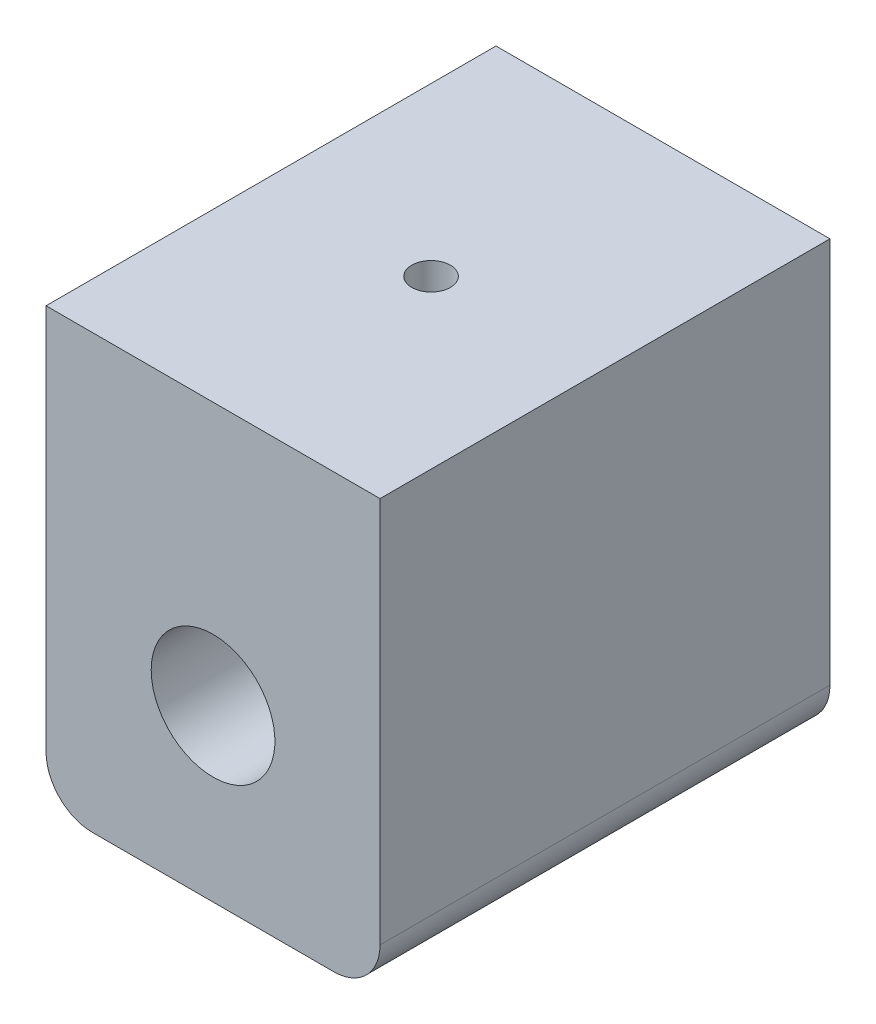
ISO-10303-21;
HEADER;
FILE_DESCRIPTION(('STEP AP214'),'2;1');
FILE_NAME('part.step','',(''),(''),'','','');
FILE_SCHEMA(('AUTOMOTIVE_DESIGN { 1 0 10303 214 1 1 1 1 }'));
ENDSEC;
DATA;
#1=APPLICATION_CONTEXT('core data for automotive mechanical design processes');
#2=APPLICATION_PROTOCOL_DEFINITION('international standard','automotive_design',2000,#1);
#3=PRODUCT_CONTEXT('',#1,'mechanical');
#4=PRODUCT('Part','Part','',(#3));
#5=PRODUCT_RELATED_PRODUCT_CATEGORY('part','',(#4));
#6=PRODUCT_DEFINITION_FORMATION('','',#4);
#7=PRODUCT_DEFINITION_CONTEXT('part definition',#1,'design');
#8=PRODUCT_DEFINITION('design','',#6,#7);
#9=PRODUCT_DEFINITION_SHAPE('','',#8);
#10=(LENGTH_UNIT() NAMED_UNIT(*) SI_UNIT(.MILLI.,.METRE.));
#11=(NAMED_UNIT(*) PLANE_ANGLE_UNIT() SI_UNIT($,.RADIAN.));
#12=(NAMED_UNIT(*) SI_UNIT($,.STERADIAN.) SOLID_ANGLE_UNIT());
#13=UNCERTAINTY_MEASURE_WITH_UNIT(LENGTH_MEASURE(1.E-05),#10,'distance_accuracy_value','');
#14=(GEOMETRIC_REPRESENTATION_CONTEXT(3) GLOBAL_UNCERTAINTY_ASSIGNED_CONTEXT((#13)) GLOBAL_UNIT_ASSIGNED_CONTEXT((#10,
#11,#12)) REPRESENTATION_CONTEXT('',''));
#15=CARTESIAN_POINT('',(0.,0.,0.));
#16=DIRECTION('',(0.,0.,1.));
#17=DIRECTION('',(1.,0.,0.));
#18=AXIS2_PLACEMENT_3D('',#15,#16,#17);
#19=CARTESIAN_POINT('',(-5.86092041698449,10.9504195270786,-63.7));
#20=DIRECTION('',(0.,-1.,0.));
#21=DIRECTION('',(0.,0.,-1.));
#22=AXIS2_PLACEMENT_3D('',#19,#20,#21);
#23=PLANE('',#22);
#24=CARTESIAN_POINT('',(-5.86092041698448,10.9504195270786,-63.7));
#25=DIRECTION('',(0.,-1.,0.));
#26=DIRECTION('',(0.,0.,-1.));
#27=AXIS2_PLACEMENT_3D('',#24,#25,#26);
#28=CIRCLE('',#27,1.25);
#29=CARTESIAN_POINT('',(-5.86092041698448,10.9504195270786,-64.95));
#30=VERTEX_POINT('',#29);
#31=EDGE_CURVE('E21',#30,#30,#28,.F.);
#32=ORIENTED_EDGE('',*,*,#31,.T.);
#33=EDGE_LOOP('',(#32));
#34=FACE_BOUND('',#33,.T.);
#35=ADVANCED_FACE('F18',(#34),#23,.F.);
#36=CARTESIAN_POINT('',(-5.86092041698448,17.9504195270786,-63.7));
#37=DIRECTION('',(0.,-1.,0.));
#38=DIRECTION('',(0.,0.,-1.));
#39=AXIS2_PLACEMENT_3D('',#36,#37,#38);
#40=CYLINDRICAL_SURFACE('',#39,1.25);
#41=CARTESIAN_POINT('',(-5.86092041698448,17.9504195270786,-63.7));
#42=DIRECTION('',(0.,-1.,0.));
#43=DIRECTION('',(0.,0.,-1.));
#44=AXIS2_PLACEMENT_3D('',#41,#42,#43);
#45=CIRCLE('',#44,1.25);
#46=CARTESIAN_POINT('',(-5.86092041698448,17.9504195270786,-64.95));
#47=VERTEX_POINT('',#46);
#48=EDGE_CURVE('E121',#47,#47,#45,.T.);
#49=ORIENTED_EDGE('',*,*,#48,.F.);
#50=EDGE_LOOP('',(#49));
#51=FACE_BOUND('',#50,.T.);
#52=ORIENTED_EDGE('',*,*,#31,.F.);
#53=EDGE_LOOP('',(#52));
#54=FACE_BOUND('',#53,.T.);
#55=ADVANCED_FACE('F156',(#51,#54),#40,.F.);
#56=CARTESIAN_POINT('',(-16.6609204169845,-10.0495804729214,-78.7));
#57=DIRECTION('',(-1.,0.,0.));
#58=DIRECTION('',(0.,0.,1.));
#59=AXIS2_PLACEMENT_3D('',#56,#57,#58);
#60=PLANE('',#59);
#61=DIRECTION('',(0.,1.,0.));
#62=VECTOR('',#61,1.);
#63=CARTESIAN_POINT('',(-16.6609204169845,-0.169434475005503,-78.7));
#64=LINE('',#63,#62);
#65=CARTESIAN_POINT('',(-16.6609204169845,-7.04958047292143,-78.7));
#66=VERTEX_POINT('',#65);
#67=CARTESIAN_POINT('',(-16.6609204169845,17.9504195270786,-78.7));
#68=VERTEX_POINT('',#67);
#69=EDGE_CURVE('E72',#66,#68,#64,.T.);
#70=ORIENTED_EDGE('',*,*,#69,.F.);
#71=DIRECTION('',(0.,0.,-1.));
#72=VECTOR('',#71,1.);
#73=CARTESIAN_POINT('',(-16.6609204169845,-7.04958047292143,-78.7));
#74=LINE('',#73,#72);
#75=CARTESIAN_POINT('',(-16.6609204169845,-7.04958047292143,-49.6));
#76=VERTEX_POINT('',#75);
#77=EDGE_CURVE('E65',#76,#66,#74,.T.);
#78=ORIENTED_EDGE('',*,*,#77,.F.);
#79=DIRECTION('',(0.,1.,0.));
#80=VECTOR('',#79,1.);
#81=CARTESIAN_POINT('',(-16.6609204169845,-0.169434475005503,-49.6));
#82=LINE('',#81,#80);
#83=CARTESIAN_POINT('',(-16.6609204169845,17.9504195270786,-49.6));
#84=VERTEX_POINT('',#83);
#85=EDGE_CURVE('E133',#76,#84,#82,.T.);
#86=ORIENTED_EDGE('',*,*,#85,.T.);
#87=DIRECTION('',(0.,0.,1.));
#88=VECTOR('',#87,1.);
#89=CARTESIAN_POINT('',(-16.6609204169845,17.9504195270786,-78.7));
#90=LINE('',#89,#88);
#91=EDGE_CURVE('E90',#68,#84,#90,.T.);
#92=ORIENTED_EDGE('',*,*,#91,.F.);
#93=EDGE_LOOP('',(#70,#78,#86,#92));
#94=FACE_BOUND('',#93,.T.);
#95=ADVANCED_FACE('F154',(#94),#60,.T.);
#96=CARTESIAN_POINT('',(-13.6609204169845,-7.04958047292143,-78.7));
#97=DIRECTION('',(0.,0.,-1.));
#98=DIRECTION('',(-1.,0.,0.));
#99=AXIS2_PLACEMENT_3D('',#96,#97,#98);
#100=CYLINDRICAL_SURFACE('',#99,3.);
#101=CARTESIAN_POINT('',(-13.6609204169845,-7.04958047292143,-78.7));
#102=DIRECTION('',(0.,0.,-1.));
#103=DIRECTION('',(-1.,0.,0.));
#104=AXIS2_PLACEMENT_3D('',#101,#102,#103);
#105=CIRCLE('',#104,3.);
#106=CARTESIAN_POINT('',(-13.6609204169845,-10.0495804729214,-78.7));
#107=VERTEX_POINT('',#106);
#108=EDGE_CURVE('E112',#107,#66,#105,.T.);
#109=ORIENTED_EDGE('',*,*,#108,.F.);
#110=DIRECTION('',(0.,0.,-1.));
#111=VECTOR('',#110,1.);
#112=CARTESIAN_POINT('',(-13.6609204169845,-10.0495804729214,-78.7));
#113=LINE('',#112,#111);
#114=CARTESIAN_POINT('',(-13.6609204169845,-10.0495804729214,-49.6));
#115=VERTEX_POINT('',#114);
#116=EDGE_CURVE('E60',#115,#107,#113,.T.);
#117=ORIENTED_EDGE('',*,*,#116,.F.);
#118=CARTESIAN_POINT('',(-13.6609204169845,-7.04958047292143,-49.6));
#119=DIRECTION('',(0.,0.,-1.));
#120=DIRECTION('',(-1.,0.,0.));
#121=AXIS2_PLACEMENT_3D('',#118,#119,#120);
#122=CIRCLE('',#121,3.);
#123=EDGE_CURVE('E128',#115,#76,#122,.T.);
#124=ORIENTED_EDGE('',*,*,#123,.T.);
#125=ORIENTED_EDGE('',*,*,#77,.T.);
#126=EDGE_LOOP('',(#109,#117,#124,#125));
#127=FACE_BOUND('',#126,.T.);
#128=ADVANCED_FACE('F135',(#127),#100,.T.);
#129=CARTESIAN_POINT('',(-5.86092041698449,0.950419527078566,-78.7));
#130=DIRECTION('',(0.,0.,-1.));
#131=DIRECTION('',(-1.,0.,0.));
#132=AXIS2_PLACEMENT_3D('',#129,#130,#131);
#133=CYLINDRICAL_SURFACE('',#132,4.);
#134=CARTESIAN_POINT('',(-5.86092041698449,0.950419527078566,-49.6));
#135=DIRECTION('',(0.,0.,-1.));
#136=DIRECTION('',(-1.,0.,0.));
#137=AXIS2_PLACEMENT_3D('',#134,#135,#136);
#138=CIRCLE('',#137,4.);
#139=CARTESIAN_POINT('',(-9.86092041698449,0.950419527078566,-49.6));
#140=VERTEX_POINT('',#139);
#141=EDGE_CURVE('E125',#140,#140,#138,.F.);
#142=ORIENTED_EDGE('',*,*,#141,.T.);
#143=EDGE_LOOP('',(#142));
#144=FACE_BOUND('',#143,.T.);
#145=CARTESIAN_POINT('',(-5.86092041698449,0.950419527078566,-78.7));
#146=DIRECTION('',(0.,0.,-1.));
#147=DIRECTION('',(-1.,0.,0.));
#148=AXIS2_PLACEMENT_3D('',#145,#146,#147);
#149=CIRCLE('',#148,4.);
#150=CARTESIAN_POINT('',(-9.86092041698449,0.950419527078566,-78.7));
#151=VERTEX_POINT('',#150);
#152=EDGE_CURVE('E91',#151,#151,#149,.F.);
#153=ORIENTED_EDGE('',*,*,#152,.F.);
#154=EDGE_LOOP('',(#153));
#155=FACE_BOUND('',#154,.T.);
#156=ADVANCED_FACE('F163',(#144,#155),#133,.F.);
#157=CARTESIAN_POINT('',(4.93907958301551,-10.0495804729214,-78.7));
#158=DIRECTION('',(0.,-1.,0.));
#159=DIRECTION('',(0.,0.,-1.));
#160=AXIS2_PLACEMENT_3D('',#157,#158,#159);
#161=PLANE('',#160);
#162=DIRECTION('',(-1.,0.,0.));
#163=VECTOR('',#162,1.);
#164=CARTESIAN_POINT('',(-7.9824365322079,-10.0495804729214,-49.6));
#165=LINE('',#164,#163);
#166=CARTESIAN_POINT('',(1.93907958301551,-10.0495804729214,-49.6));
#167=VERTEX_POINT('',#166);
#168=EDGE_CURVE('E130',#167,#115,#165,.T.);
#169=ORIENTED_EDGE('',*,*,#168,.T.);
#170=ORIENTED_EDGE('',*,*,#116,.T.);
#171=DIRECTION('',(-1.,0.,0.));
#172=VECTOR('',#171,1.);
#173=CARTESIAN_POINT('',(-7.9824365322079,-10.0495804729214,-78.7));
#174=LINE('',#173,#172);
#175=CARTESIAN_POINT('',(1.93907958301551,-10.0495804729214,-78.7));
#176=VERTEX_POINT('',#175);
#177=EDGE_CURVE('E78',#176,#107,#174,.T.);
#178=ORIENTED_EDGE('',*,*,#177,.F.);
#179=DIRECTION('',(0.,0.,-1.));
#180=VECTOR('',#179,1.);
#181=CARTESIAN_POINT('',(1.93907958301551,-10.0495804729214,-78.7));
#182=LINE('',#181,#180);
#183=EDGE_CURVE('E104',#167,#176,#182,.T.);
#184=ORIENTED_EDGE('',*,*,#183,.F.);
#185=EDGE_LOOP('',(#169,#170,#178,#184));
#186=FACE_BOUND('',#185,.T.);
#187=ADVANCED_FACE('F138',(#186),#161,.T.);
#188=CARTESIAN_POINT('',(-7.9824365322079,-0.169434475005503,-78.7));
#189=DIRECTION('',(0.,0.,-1.));
#190=DIRECTION('',(-1.,0.,0.));
#191=AXIS2_PLACEMENT_3D('',#188,#189,#190);
#192=PLANE('',#191);
#193=ORIENTED_EDGE('',*,*,#152,.T.);
#194=EDGE_LOOP('',(#193));
#195=FACE_BOUND('',#194,.T.);
#196=ORIENTED_EDGE('',*,*,#69,.T.);
#197=DIRECTION('',(1.,0.,0.));
#198=VECTOR('',#197,1.);
#199=CARTESIAN_POINT('',(-16.6609204169845,17.9504195270786,-78.7));
#200=LINE('',#199,#198);
#201=CARTESIAN_POINT('',(4.93907958301551,17.9504195270786,-78.7));
#202=VERTEX_POINT('',#201);
#203=EDGE_CURVE('E85',#202,#68,#200,.F.);
#204=ORIENTED_EDGE('',*,*,#203,.F.);
#205=DIRECTION('',(0.,1.,0.));
#206=VECTOR('',#205,1.);
#207=CARTESIAN_POINT('',(4.93907958301551,17.9504195270786,-78.7));
#208=LINE('',#207,#206);
#209=CARTESIAN_POINT('',(4.93907958301551,-7.04958047292143,-78.7));
#210=VERTEX_POINT('',#209);
#211=EDGE_CURVE('E82',#210,#202,#208,.T.);
#212=ORIENTED_EDGE('',*,*,#211,.F.);
#213=CARTESIAN_POINT('',(1.93907958301551,-7.04958047292143,-78.7));
#214=DIRECTION('',(0.,0.,-1.));
#215=DIRECTION('',(-1.,0.,0.));
#216=AXIS2_PLACEMENT_3D('',#213,#214,#215);
#217=CIRCLE('',#216,3.);
#218=EDGE_CURVE('E102',#176,#210,#217,.F.);
#219=ORIENTED_EDGE('',*,*,#218,.F.);
#220=ORIENTED_EDGE('',*,*,#177,.T.);
#221=ORIENTED_EDGE('',*,*,#108,.T.);
#222=EDGE_LOOP('',(#196,#204,#212,#219,#220,#221));
#223=FACE_BOUND('',#222,.T.);
#224=ADVANCED_FACE('F87',(#195,#223),#192,.T.);
#225=CARTESIAN_POINT('',(-16.6609204169845,17.9504195270786,-78.7));
#226=DIRECTION('',(0.,1.,0.));
#227=DIRECTION('',(0.,0.,1.));
#228=AXIS2_PLACEMENT_3D('',#225,#226,#227);
#229=PLANE('',#228);
#230=ORIENTED_EDGE('',*,*,#48,.T.);
#231=EDGE_LOOP('',(#230));
#232=FACE_BOUND('',#231,.T.);
#233=DIRECTION('',(-1.,0.,0.));
#234=VECTOR('',#233,1.);
#235=CARTESIAN_POINT('',(-7.9824365322079,17.9504195270786,-49.6));
#236=LINE('',#235,#234);
#237=CARTESIAN_POINT('',(4.93907958301551,17.9504195270786,-49.6));
#238=VERTEX_POINT('',#237);
#239=EDGE_CURVE('E97',#84,#238,#236,.F.);
#240=ORIENTED_EDGE('',*,*,#239,.T.);
#241=DIRECTION('',(0.,0.,-1.));
#242=VECTOR('',#241,1.);
#243=CARTESIAN_POINT('',(4.93907958301551,17.9504195270786,-78.7));
#244=LINE('',#243,#242);
#245=EDGE_CURVE('E94',#202,#238,#244,.F.);
#246=ORIENTED_EDGE('',*,*,#245,.F.);
#247=ORIENTED_EDGE('',*,*,#203,.T.);
#248=ORIENTED_EDGE('',*,*,#91,.T.);
#249=EDGE_LOOP('',(#240,#246,#247,#248));
#250=FACE_BOUND('',#249,.T.);
#251=ADVANCED_FACE('F95',(#232,#250),#229,.T.);
#252=CARTESIAN_POINT('',(-7.9824365322079,-0.169434475005503,-49.6));
#253=DIRECTION('',(0.,0.,-1.));
#254=DIRECTION('',(-1.,0.,0.));
#255=AXIS2_PLACEMENT_3D('',#252,#253,#254);
#256=PLANE('',#255);
#257=ORIENTED_EDGE('',*,*,#141,.F.);
#258=EDGE_LOOP('',(#257));
#259=FACE_BOUND('',#258,.T.);
#260=ORIENTED_EDGE('',*,*,#168,.F.);
#261=CARTESIAN_POINT('',(1.93907958301551,-7.04958047292143,-49.6));
#262=DIRECTION('',(0.,0.,-1.));
#263=DIRECTION('',(-1.,0.,0.));
#264=AXIS2_PLACEMENT_3D('',#261,#262,#263);
#265=CIRCLE('',#264,3.);
#266=CARTESIAN_POINT('',(4.93907958301551,-7.04958047292143,-49.6));
#267=VERTEX_POINT('',#266);
#268=EDGE_CURVE('E36',#267,#167,#265,.T.);
#269=ORIENTED_EDGE('',*,*,#268,.F.);
#270=DIRECTION('',(0.,1.,0.));
#271=VECTOR('',#270,1.);
#272=CARTESIAN_POINT('',(4.93907958301551,17.9504195270786,-49.6));
#273=LINE('',#272,#271);
#274=EDGE_CURVE('E27',#238,#267,#273,.F.);
#275=ORIENTED_EDGE('',*,*,#274,.F.);
#276=ORIENTED_EDGE('',*,*,#239,.F.);
#277=ORIENTED_EDGE('',*,*,#85,.F.);
#278=ORIENTED_EDGE('',*,*,#123,.F.);
#279=EDGE_LOOP('',(#260,#269,#275,#276,#277,#278));
#280=FACE_BOUND('',#279,.T.);
#281=ADVANCED_FACE('F140',(#259,#280),#256,.F.);
#282=CARTESIAN_POINT('',(1.93907958301551,-7.04958047292143,-78.7));
#283=DIRECTION('',(0.,0.,-1.));
#284=DIRECTION('',(-1.,0.,0.));
#285=AXIS2_PLACEMENT_3D('',#282,#283,#284);
#286=CYLINDRICAL_SURFACE('',#285,3.);
#287=ORIENTED_EDGE('',*,*,#218,.T.);
#288=DIRECTION('',(0.,0.,-1.));
#289=VECTOR('',#288,1.);
#290=CARTESIAN_POINT('',(4.93907958301551,-7.04958047292143,-78.7));
#291=LINE('',#290,#289);
#292=EDGE_CURVE('E11',#267,#210,#291,.T.);
#293=ORIENTED_EDGE('',*,*,#292,.F.);
#294=ORIENTED_EDGE('',*,*,#268,.T.);
#295=ORIENTED_EDGE('',*,*,#183,.T.);
#296=EDGE_LOOP('',(#287,#293,#294,#295));
#297=FACE_BOUND('',#296,.T.);
#298=ADVANCED_FACE('F167',(#297),#286,.T.);
#299=CARTESIAN_POINT('',(4.93907958301551,17.9504195270786,-78.7));
#300=DIRECTION('',(1.,0.,0.));
#301=DIRECTION('',(0.,0.,-1.));
#302=AXIS2_PLACEMENT_3D('',#299,#300,#301);
#303=PLANE('',#302);
#304=ORIENTED_EDGE('',*,*,#274,.T.);
#305=ORIENTED_EDGE('',*,*,#292,.T.);
#306=ORIENTED_EDGE('',*,*,#211,.T.);
#307=ORIENTED_EDGE('',*,*,#245,.T.);
#308=EDGE_LOOP('',(#304,#305,#306,#307));
#309=FACE_BOUND('',#308,.T.);
#310=ADVANCED_FACE('F101',(#309),#303,.T.);
#311=CLOSED_SHELL('',(#35,#55,#95,#128,#156,#187,#224,#251,#281,#298,#310));
#312=MANIFOLD_SOLID_BREP('B1',#311);
#313=ADVANCED_BREP_SHAPE_REPRESENTATION('',(#18,#312),#14);
#314=SHAPE_DEFINITION_REPRESENTATION(#9,#313);
ENDSEC;
END-ISO-10303-21;
